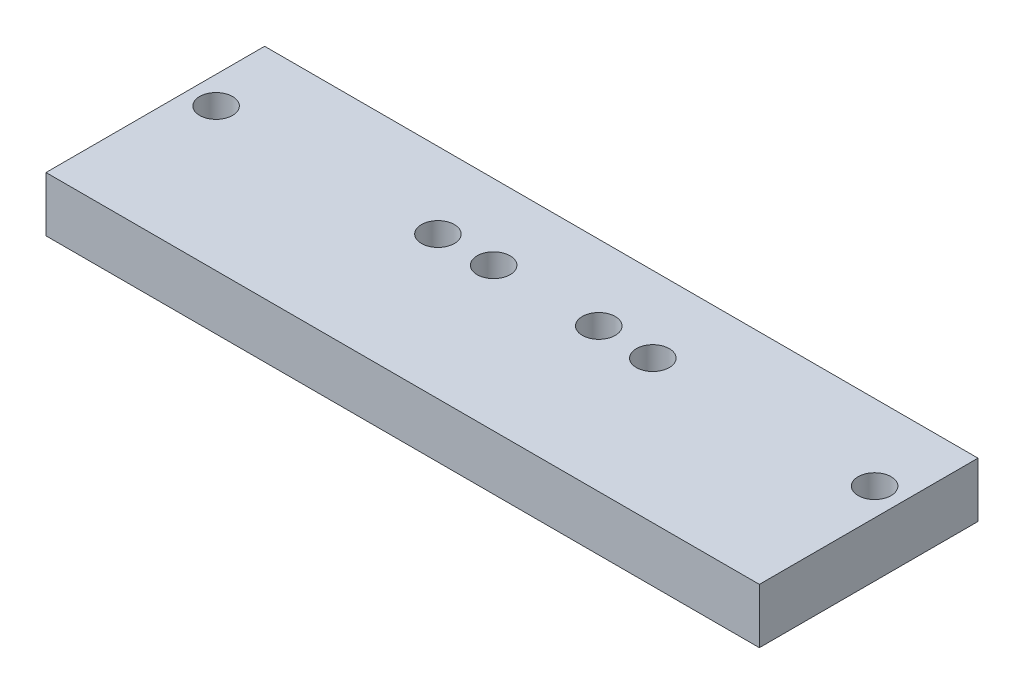
ISO-10303-21;
HEADER;
FILE_DESCRIPTION(('STEP AP214'),'2;1');
FILE_NAME('part.step','',(''),(''),'','','');
FILE_SCHEMA(('AUTOMOTIVE_DESIGN { 1 0 10303 214 1 1 1 1 }'));
ENDSEC;
DATA;
#1=APPLICATION_CONTEXT('core data for automotive mechanical design processes');
#2=APPLICATION_PROTOCOL_DEFINITION('international standard','automotive_design',2000,#1);
#3=PRODUCT_CONTEXT('',#1,'mechanical');
#4=PRODUCT('Part','Part','',(#3));
#5=PRODUCT_RELATED_PRODUCT_CATEGORY('part','',(#4));
#6=PRODUCT_DEFINITION_FORMATION('','',#4);
#7=PRODUCT_DEFINITION_CONTEXT('part definition',#1,'design');
#8=PRODUCT_DEFINITION('design','',#6,#7);
#9=PRODUCT_DEFINITION_SHAPE('','',#8);
#10=(LENGTH_UNIT() NAMED_UNIT(*) SI_UNIT(.MILLI.,.METRE.));
#11=(NAMED_UNIT(*) PLANE_ANGLE_UNIT() SI_UNIT($,.RADIAN.));
#12=(NAMED_UNIT(*) SI_UNIT($,.STERADIAN.) SOLID_ANGLE_UNIT());
#13=UNCERTAINTY_MEASURE_WITH_UNIT(LENGTH_MEASURE(1.E-05),#10,'distance_accuracy_value','');
#14=(GEOMETRIC_REPRESENTATION_CONTEXT(3) GLOBAL_UNCERTAINTY_ASSIGNED_CONTEXT((#13)) GLOBAL_UNIT_ASSIGNED_CONTEXT((#10,
#11,#12)) REPRESENTATION_CONTEXT('',''));
#15=CARTESIAN_POINT('',(0.,0.,0.));
#16=DIRECTION('',(0.,0.,1.));
#17=DIRECTION('',(1.,0.,0.));
#18=AXIS2_PLACEMENT_3D('',#15,#16,#17);
#19=CARTESIAN_POINT('',(0.,10.,0.));
#20=DIRECTION('',(1.,0.,0.));
#21=DIRECTION('',(0.,0.,-1.));
#22=AXIS2_PLACEMENT_3D('',#19,#20,#21);
#23=PLANE('',#22);
#24=DIRECTION('',(0.,0.,1.));
#25=VECTOR('',#24,1.);
#26=CARTESIAN_POINT('',(0.,0.,0.));
#27=LINE('',#26,#25);
#28=CARTESIAN_POINT('',(0.,0.,-39.84));
#29=VERTEX_POINT('',#28);
#30=CARTESIAN_POINT('',(0.,0.,0.));
#31=VERTEX_POINT('',#30);
#32=EDGE_CURVE('E98',#29,#31,#27,.T.);
#33=ORIENTED_EDGE('',*,*,#32,.T.);
#34=DIRECTION('',(0.,-1.,0.));
#35=VECTOR('',#34,1.);
#36=CARTESIAN_POINT('',(0.,10.,0.));
#37=LINE('',#36,#35);
#38=CARTESIAN_POINT('',(0.,10.,0.));
#39=VERTEX_POINT('',#38);
#40=EDGE_CURVE('E11',#39,#31,#37,.T.);
#41=ORIENTED_EDGE('',*,*,#40,.F.);
#42=DIRECTION('',(0.,0.,1.));
#43=VECTOR('',#42,1.);
#44=CARTESIAN_POINT('',(0.,10.,0.));
#45=LINE('',#44,#43);
#46=CARTESIAN_POINT('',(0.,10.,-39.84));
#47=VERTEX_POINT('',#46);
#48=EDGE_CURVE('E86',#47,#39,#45,.T.);
#49=ORIENTED_EDGE('',*,*,#48,.F.);
#50=DIRECTION('',(0.,-1.,0.));
#51=VECTOR('',#50,1.);
#52=CARTESIAN_POINT('',(0.,10.,-39.84));
#53=LINE('',#52,#51);
#54=EDGE_CURVE('E94',#47,#29,#53,.T.);
#55=ORIENTED_EDGE('',*,*,#54,.T.);
#56=EDGE_LOOP('',(#33,#41,#49,#55));
#57=FACE_BOUND('',#56,.T.);
#58=ADVANCED_FACE('F35',(#57),#23,.F.);
#59=CARTESIAN_POINT('',(0.,10.,0.));
#60=DIRECTION('',(0.,0.,-1.));
#61=DIRECTION('',(-1.,0.,0.));
#62=AXIS2_PLACEMENT_3D('',#59,#60,#61);
#63=PLANE('',#62);
#64=DIRECTION('',(1.,0.,0.));
#65=VECTOR('',#64,1.);
#66=CARTESIAN_POINT('',(0.,0.,0.));
#67=LINE('',#66,#65);
#68=CARTESIAN_POINT('',(130.,0.,0.));
#69=VERTEX_POINT('',#68);
#70=EDGE_CURVE('E90',#31,#69,#67,.T.);
#71=ORIENTED_EDGE('',*,*,#70,.T.);
#72=DIRECTION('',(0.,-1.,0.));
#73=VECTOR('',#72,1.);
#74=CARTESIAN_POINT('',(130.,10.,0.));
#75=LINE('',#74,#73);
#76=CARTESIAN_POINT('',(130.,10.,0.));
#77=VERTEX_POINT('',#76);
#78=EDGE_CURVE('E43',#77,#69,#75,.T.);
#79=ORIENTED_EDGE('',*,*,#78,.F.);
#80=DIRECTION('',(1.,0.,0.));
#81=VECTOR('',#80,1.);
#82=CARTESIAN_POINT('',(0.,10.,0.));
#83=LINE('',#82,#81);
#84=EDGE_CURVE('E81',#39,#77,#83,.T.);
#85=ORIENTED_EDGE('',*,*,#84,.F.);
#86=ORIENTED_EDGE('',*,*,#40,.T.);
#87=EDGE_LOOP('',(#71,#79,#85,#86));
#88=FACE_BOUND('',#87,.T.);
#89=ADVANCED_FACE('F89',(#88),#63,.F.);
#90=CARTESIAN_POINT('',(130.,10.,0.));
#91=DIRECTION('',(-1.,0.,0.));
#92=DIRECTION('',(0.,0.,1.));
#93=AXIS2_PLACEMENT_3D('',#90,#91,#92);
#94=PLANE('',#93);
#95=DIRECTION('',(0.,0.,-1.));
#96=VECTOR('',#95,1.);
#97=CARTESIAN_POINT('',(130.,0.,0.));
#98=LINE('',#97,#96);
#99=CARTESIAN_POINT('',(130.,0.,-39.84));
#100=VERTEX_POINT('',#99);
#101=EDGE_CURVE('E68',#69,#100,#98,.T.);
#102=ORIENTED_EDGE('',*,*,#101,.T.);
#103=DIRECTION('',(0.,-1.,0.));
#104=VECTOR('',#103,1.);
#105=CARTESIAN_POINT('',(130.,10.,-39.84));
#106=LINE('',#105,#104);
#107=CARTESIAN_POINT('',(130.,10.,-39.84));
#108=VERTEX_POINT('',#107);
#109=EDGE_CURVE('E91',#108,#100,#106,.T.);
#110=ORIENTED_EDGE('',*,*,#109,.F.);
#111=DIRECTION('',(0.,0.,-1.));
#112=VECTOR('',#111,1.);
#113=CARTESIAN_POINT('',(130.,10.,0.));
#114=LINE('',#113,#112);
#115=EDGE_CURVE('E84',#77,#108,#114,.T.);
#116=ORIENTED_EDGE('',*,*,#115,.F.);
#117=ORIENTED_EDGE('',*,*,#78,.T.);
#118=EDGE_LOOP('',(#102,#110,#116,#117));
#119=FACE_BOUND('',#118,.T.);
#120=ADVANCED_FACE('F92',(#119),#94,.F.);
#121=CARTESIAN_POINT('',(0.,10.,-39.84));
#122=DIRECTION('',(0.,0.,1.));
#123=DIRECTION('',(1.,0.,0.));
#124=AXIS2_PLACEMENT_3D('',#121,#122,#123);
#125=PLANE('',#124);
#126=DIRECTION('',(-1.,0.,0.));
#127=VECTOR('',#126,1.);
#128=CARTESIAN_POINT('',(0.,0.,-39.84));
#129=LINE('',#128,#127);
#130=EDGE_CURVE('E74',#100,#29,#129,.T.);
#131=ORIENTED_EDGE('',*,*,#130,.T.);
#132=ORIENTED_EDGE('',*,*,#54,.F.);
#133=DIRECTION('',(-1.,0.,0.));
#134=VECTOR('',#133,1.);
#135=CARTESIAN_POINT('',(0.,10.,-39.84));
#136=LINE('',#135,#134);
#137=EDGE_CURVE('E51',#108,#47,#136,.T.);
#138=ORIENTED_EDGE('',*,*,#137,.F.);
#139=ORIENTED_EDGE('',*,*,#109,.T.);
#140=EDGE_LOOP('',(#131,#132,#138,#139));
#141=FACE_BOUND('',#140,.T.);
#142=ADVANCED_FACE('F106',(#141),#125,.F.);
#143=CARTESIAN_POINT('',(0.,10.,0.));
#144=DIRECTION('',(0.,-1.,0.));
#145=DIRECTION('',(0.,0.,-1.));
#146=AXIS2_PLACEMENT_3D('',#143,#144,#145);
#147=PLANE('',#146);
#148=CARTESIAN_POINT('',(125.,10.,-25.9990538912221));
#149=DIRECTION('',(0.,1.,0.));
#150=DIRECTION('',(0.,0.,1.));
#151=AXIS2_PLACEMENT_3D('',#148,#149,#150);
#152=CIRCLE('',#151,2.99999999999999);
#153=CARTESIAN_POINT('',(125.,10.,-22.9990538912222));
#154=VERTEX_POINT('',#153);
#155=EDGE_CURVE('E142',#154,#154,#152,.T.);
#156=ORIENTED_EDGE('',*,*,#155,.F.);
#157=EDGE_LOOP('',(#156));
#158=FACE_BOUND('',#157,.T.);
#159=CARTESIAN_POINT('',(84.58,10.,-25.9990538912221));
#160=DIRECTION('',(0.,1.,0.));
#161=DIRECTION('',(0.,0.,1.));
#162=AXIS2_PLACEMENT_3D('',#159,#160,#161);
#163=CIRCLE('',#162,3.00000000000001);
#164=CARTESIAN_POINT('',(84.58,10.,-22.9990538912221));
#165=VERTEX_POINT('',#164);
#166=EDGE_CURVE('E136',#165,#165,#163,.T.);
#167=ORIENTED_EDGE('',*,*,#166,.F.);
#168=EDGE_LOOP('',(#167));
#169=FACE_BOUND('',#168,.T.);
#170=CARTESIAN_POINT('',(74.58,10.,-26.1507563485497));
#171=DIRECTION('',(0.,1.,0.));
#172=DIRECTION('',(0.,0.,1.));
#173=AXIS2_PLACEMENT_3D('',#170,#171,#172);
#174=CIRCLE('',#173,2.99999999999999);
#175=CARTESIAN_POINT('',(74.58,10.,-23.1507563485497));
#176=VERTEX_POINT('',#175);
#177=EDGE_CURVE('E130',#176,#176,#174,.T.);
#178=ORIENTED_EDGE('',*,*,#177,.F.);
#179=EDGE_LOOP('',(#178));
#180=FACE_BOUND('',#179,.T.);
#181=CARTESIAN_POINT('',(55.42,10.,-26.1507563485497));
#182=DIRECTION('',(0.,1.,0.));
#183=DIRECTION('',(0.,0.,1.));
#184=AXIS2_PLACEMENT_3D('',#181,#182,#183);
#185=CIRCLE('',#184,3.);
#186=CARTESIAN_POINT('',(55.42,10.,-23.1507563485497));
#187=VERTEX_POINT('',#186);
#188=EDGE_CURVE('E124',#187,#187,#185,.T.);
#189=ORIENTED_EDGE('',*,*,#188,.F.);
#190=EDGE_LOOP('',(#189));
#191=FACE_BOUND('',#190,.T.);
#192=CARTESIAN_POINT('',(45.42,10.,-25.9990538912221));
#193=DIRECTION('',(0.,1.,0.));
#194=DIRECTION('',(0.,0.,1.));
#195=AXIS2_PLACEMENT_3D('',#192,#193,#194);
#196=CIRCLE('',#195,3.);
#197=CARTESIAN_POINT('',(45.42,10.,-22.9990538912221));
#198=VERTEX_POINT('',#197);
#199=EDGE_CURVE('E118',#198,#198,#196,.T.);
#200=ORIENTED_EDGE('',*,*,#199,.F.);
#201=EDGE_LOOP('',(#200));
#202=FACE_BOUND('',#201,.T.);
#203=CARTESIAN_POINT('',(4.99999999999994,10.,-25.9990538912221));
#204=DIRECTION('',(0.,1.,0.));
#205=DIRECTION('',(0.,0.,1.));
#206=AXIS2_PLACEMENT_3D('',#203,#204,#205);
#207=CIRCLE('',#206,3.00000000000002);
#208=CARTESIAN_POINT('',(4.99999999999994,10.,-22.9990538912221));
#209=VERTEX_POINT('',#208);
#210=EDGE_CURVE('E112',#209,#209,#207,.T.);
#211=ORIENTED_EDGE('',*,*,#210,.F.);
#212=EDGE_LOOP('',(#211));
#213=FACE_BOUND('',#212,.T.);
#214=ORIENTED_EDGE('',*,*,#48,.T.);
#215=ORIENTED_EDGE('',*,*,#84,.T.);
#216=ORIENTED_EDGE('',*,*,#115,.T.);
#217=ORIENTED_EDGE('',*,*,#137,.T.);
#218=EDGE_LOOP('',(#214,#215,#216,#217));
#219=FACE_BOUND('',#218,.T.);
#220=ADVANCED_FACE('F82',(#158,#169,#180,#191,#202,#213,#219),#147,.F.);
#221=CARTESIAN_POINT('',(0.,0.,0.));
#222=DIRECTION('',(0.,-1.,0.));
#223=DIRECTION('',(0.,0.,-1.));
#224=AXIS2_PLACEMENT_3D('',#221,#222,#223);
#225=PLANE('',#224);
#226=CARTESIAN_POINT('',(125.,0.,-25.9990538912221));
#227=DIRECTION('',(0.,1.,0.));
#228=DIRECTION('',(0.,0.,1.));
#229=AXIS2_PLACEMENT_3D('',#226,#227,#228);
#230=CIRCLE('',#229,2.99999999999999);
#231=CARTESIAN_POINT('',(125.,0.,-22.9990538912222));
#232=VERTEX_POINT('',#231);
#233=EDGE_CURVE('E139',#232,#232,#230,.T.);
#234=ORIENTED_EDGE('',*,*,#233,.T.);
#235=EDGE_LOOP('',(#234));
#236=FACE_BOUND('',#235,.T.);
#237=CARTESIAN_POINT('',(84.58,0.,-25.9990538912221));
#238=DIRECTION('',(0.,1.,0.));
#239=DIRECTION('',(0.,0.,1.));
#240=AXIS2_PLACEMENT_3D('',#237,#238,#239);
#241=CIRCLE('',#240,3.00000000000001);
#242=CARTESIAN_POINT('',(84.58,0.,-22.9990538912221));
#243=VERTEX_POINT('',#242);
#244=EDGE_CURVE('E133',#243,#243,#241,.T.);
#245=ORIENTED_EDGE('',*,*,#244,.T.);
#246=EDGE_LOOP('',(#245));
#247=FACE_BOUND('',#246,.T.);
#248=CARTESIAN_POINT('',(74.58,0.,-26.1507563485497));
#249=DIRECTION('',(0.,1.,0.));
#250=DIRECTION('',(0.,0.,1.));
#251=AXIS2_PLACEMENT_3D('',#248,#249,#250);
#252=CIRCLE('',#251,2.99999999999999);
#253=CARTESIAN_POINT('',(74.58,0.,-23.1507563485497));
#254=VERTEX_POINT('',#253);
#255=EDGE_CURVE('E127',#254,#254,#252,.T.);
#256=ORIENTED_EDGE('',*,*,#255,.T.);
#257=EDGE_LOOP('',(#256));
#258=FACE_BOUND('',#257,.T.);
#259=CARTESIAN_POINT('',(55.42,0.,-26.1507563485497));
#260=DIRECTION('',(0.,1.,0.));
#261=DIRECTION('',(0.,0.,1.));
#262=AXIS2_PLACEMENT_3D('',#259,#260,#261);
#263=CIRCLE('',#262,3.);
#264=CARTESIAN_POINT('',(55.42,0.,-23.1507563485497));
#265=VERTEX_POINT('',#264);
#266=EDGE_CURVE('E121',#265,#265,#263,.T.);
#267=ORIENTED_EDGE('',*,*,#266,.T.);
#268=EDGE_LOOP('',(#267));
#269=FACE_BOUND('',#268,.T.);
#270=CARTESIAN_POINT('',(45.42,0.,-25.9990538912221));
#271=DIRECTION('',(0.,1.,0.));
#272=DIRECTION('',(0.,0.,1.));
#273=AXIS2_PLACEMENT_3D('',#270,#271,#272);
#274=CIRCLE('',#273,3.);
#275=CARTESIAN_POINT('',(45.42,0.,-22.9990538912221));
#276=VERTEX_POINT('',#275);
#277=EDGE_CURVE('E115',#276,#276,#274,.T.);
#278=ORIENTED_EDGE('',*,*,#277,.T.);
#279=EDGE_LOOP('',(#278));
#280=FACE_BOUND('',#279,.T.);
#281=CARTESIAN_POINT('',(4.99999999999994,0.,-25.9990538912221));
#282=DIRECTION('',(0.,1.,0.));
#283=DIRECTION('',(0.,0.,1.));
#284=AXIS2_PLACEMENT_3D('',#281,#282,#283);
#285=CIRCLE('',#284,3.00000000000002);
#286=CARTESIAN_POINT('',(4.99999999999994,0.,-22.9990538912221));
#287=VERTEX_POINT('',#286);
#288=EDGE_CURVE('E101',#287,#287,#285,.T.);
#289=ORIENTED_EDGE('',*,*,#288,.T.);
#290=EDGE_LOOP('',(#289));
#291=FACE_BOUND('',#290,.T.);
#292=ORIENTED_EDGE('',*,*,#32,.F.);
#293=ORIENTED_EDGE('',*,*,#130,.F.);
#294=ORIENTED_EDGE('',*,*,#101,.F.);
#295=ORIENTED_EDGE('',*,*,#70,.F.);
#296=EDGE_LOOP('',(#292,#293,#294,#295));
#297=FACE_BOUND('',#296,.T.);
#298=ADVANCED_FACE('F109',(#236,#247,#258,#269,#280,#291,#297),#225,.T.);
#299=CARTESIAN_POINT('',(4.99999999999994,0.,-25.9990538912221));
#300=DIRECTION('',(0.,1.,0.));
#301=DIRECTION('',(0.,0.,1.));
#302=AXIS2_PLACEMENT_3D('',#299,#300,#301);
#303=CYLINDRICAL_SURFACE('',#302,3.00000000000002);
#304=ORIENTED_EDGE('',*,*,#288,.F.);
#305=EDGE_LOOP('',(#304));
#306=FACE_BOUND('',#305,.T.);
#307=ORIENTED_EDGE('',*,*,#210,.T.);
#308=EDGE_LOOP('',(#307));
#309=FACE_BOUND('',#308,.T.);
#310=ADVANCED_FACE('F170',(#306,#309),#303,.F.);
#311=CARTESIAN_POINT('',(45.42,0.,-25.9990538912221));
#312=DIRECTION('',(0.,1.,0.));
#313=DIRECTION('',(0.,0.,1.));
#314=AXIS2_PLACEMENT_3D('',#311,#312,#313);
#315=CYLINDRICAL_SURFACE('',#314,3.);
#316=ORIENTED_EDGE('',*,*,#277,.F.);
#317=EDGE_LOOP('',(#316));
#318=FACE_BOUND('',#317,.T.);
#319=ORIENTED_EDGE('',*,*,#199,.T.);
#320=EDGE_LOOP('',(#319));
#321=FACE_BOUND('',#320,.T.);
#322=ADVANCED_FACE('F172',(#318,#321),#315,.F.);
#323=CARTESIAN_POINT('',(55.42,0.,-26.1507563485497));
#324=DIRECTION('',(0.,1.,0.));
#325=DIRECTION('',(0.,0.,1.));
#326=AXIS2_PLACEMENT_3D('',#323,#324,#325);
#327=CYLINDRICAL_SURFACE('',#326,3.);
#328=ORIENTED_EDGE('',*,*,#266,.F.);
#329=EDGE_LOOP('',(#328));
#330=FACE_BOUND('',#329,.T.);
#331=ORIENTED_EDGE('',*,*,#188,.T.);
#332=EDGE_LOOP('',(#331));
#333=FACE_BOUND('',#332,.T.);
#334=ADVANCED_FACE('F179',(#330,#333),#327,.F.);
#335=CARTESIAN_POINT('',(74.58,0.,-26.1507563485497));
#336=DIRECTION('',(0.,1.,0.));
#337=DIRECTION('',(0.,0.,1.));
#338=AXIS2_PLACEMENT_3D('',#335,#336,#337);
#339=CYLINDRICAL_SURFACE('',#338,2.99999999999999);
#340=ORIENTED_EDGE('',*,*,#255,.F.);
#341=EDGE_LOOP('',(#340));
#342=FACE_BOUND('',#341,.T.);
#343=ORIENTED_EDGE('',*,*,#177,.T.);
#344=EDGE_LOOP('',(#343));
#345=FACE_BOUND('',#344,.T.);
#346=ADVANCED_FACE('F227',(#342,#345),#339,.F.);
#347=CARTESIAN_POINT('',(84.58,0.,-25.9990538912221));
#348=DIRECTION('',(0.,1.,0.));
#349=DIRECTION('',(0.,0.,1.));
#350=AXIS2_PLACEMENT_3D('',#347,#348,#349);
#351=CYLINDRICAL_SURFACE('',#350,3.00000000000001);
#352=ORIENTED_EDGE('',*,*,#244,.F.);
#353=EDGE_LOOP('',(#352));
#354=FACE_BOUND('',#353,.T.);
#355=ORIENTED_EDGE('',*,*,#166,.T.);
#356=EDGE_LOOP('',(#355));
#357=FACE_BOUND('',#356,.T.);
#358=ADVANCED_FACE('F153',(#354,#357),#351,.F.);
#359=CARTESIAN_POINT('',(125.,0.,-25.9990538912221));
#360=DIRECTION('',(0.,1.,0.));
#361=DIRECTION('',(0.,0.,1.));
#362=AXIS2_PLACEMENT_3D('',#359,#360,#361);
#363=CYLINDRICAL_SURFACE('',#362,2.99999999999999);
#364=ORIENTED_EDGE('',*,*,#233,.F.);
#365=EDGE_LOOP('',(#364));
#366=FACE_BOUND('',#365,.T.);
#367=ORIENTED_EDGE('',*,*,#155,.T.);
#368=EDGE_LOOP('',(#367));
#369=FACE_BOUND('',#368,.T.);
#370=ADVANCED_FACE('F150',(#366,#369),#363,.F.);
#371=CLOSED_SHELL('',(#58,#89,#120,#142,#220,#298,#310,#322,#334,#346,#358,#370));
#372=MANIFOLD_SOLID_BREP('B2',#371);
#373=ADVANCED_BREP_SHAPE_REPRESENTATION('',(#18,#372),#14);
#374=SHAPE_DEFINITION_REPRESENTATION(#9,#373);
ENDSEC;
END-ISO-10303-21;
